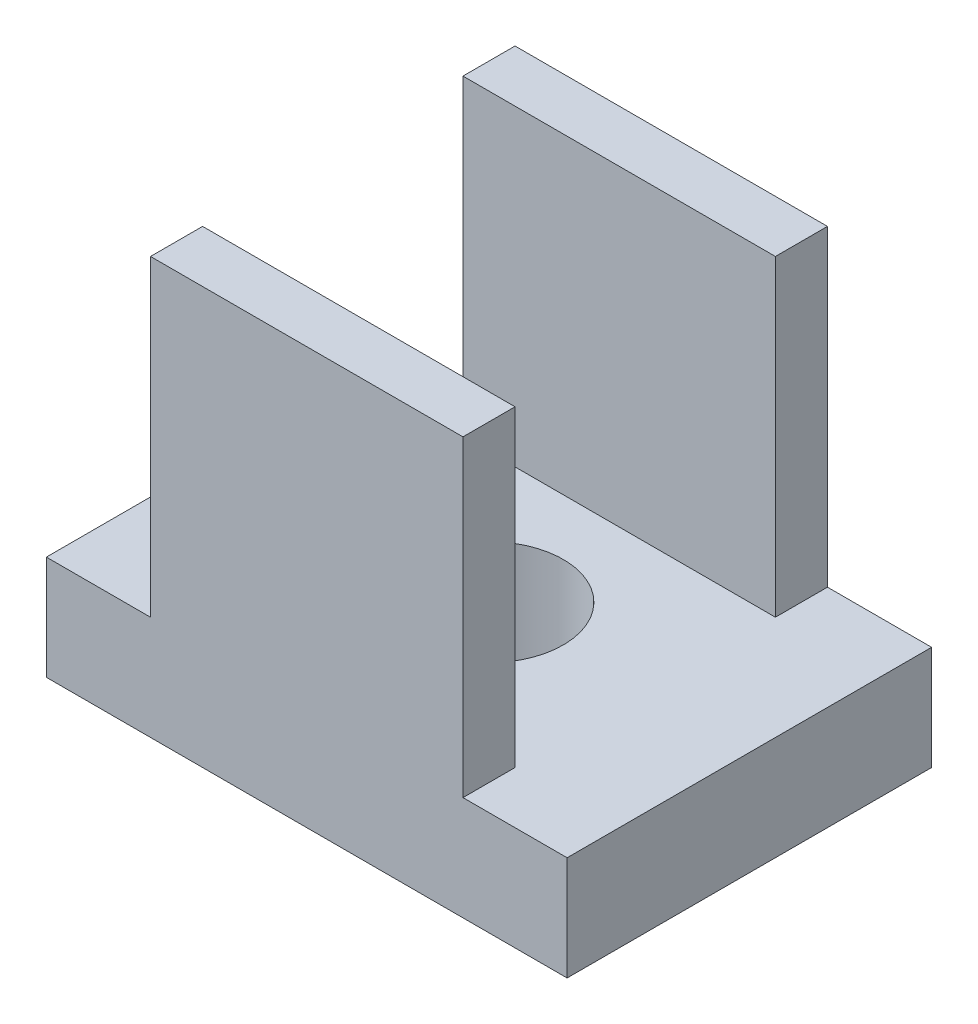
ISO-10303-21;
HEADER;
FILE_DESCRIPTION(('STEP AP214'),'2;1');
FILE_NAME('part.step','',(''),(''),'','','');
FILE_SCHEMA(('AUTOMOTIVE_DESIGN { 1 0 10303 214 1 1 1 1 }'));
ENDSEC;
DATA;
#1=APPLICATION_CONTEXT('core data for automotive mechanical design processes');
#2=APPLICATION_PROTOCOL_DEFINITION('international standard','automotive_design',2000,#1);
#3=PRODUCT_CONTEXT('',#1,'mechanical');
#4=PRODUCT('Part','Part','',(#3));
#5=PRODUCT_RELATED_PRODUCT_CATEGORY('part','',(#4));
#6=PRODUCT_DEFINITION_FORMATION('','',#4);
#7=PRODUCT_DEFINITION_CONTEXT('part definition',#1,'design');
#8=PRODUCT_DEFINITION('design','',#6,#7);
#9=PRODUCT_DEFINITION_SHAPE('','',#8);
#10=(LENGTH_UNIT() NAMED_UNIT(*) SI_UNIT(.MILLI.,.METRE.));
#11=(NAMED_UNIT(*) PLANE_ANGLE_UNIT() SI_UNIT($,.RADIAN.));
#12=(NAMED_UNIT(*) SI_UNIT($,.STERADIAN.) SOLID_ANGLE_UNIT());
#13=UNCERTAINTY_MEASURE_WITH_UNIT(LENGTH_MEASURE(1.E-05),#10,'distance_accuracy_value','');
#14=(GEOMETRIC_REPRESENTATION_CONTEXT(3) GLOBAL_UNCERTAINTY_ASSIGNED_CONTEXT((#13)) GLOBAL_UNIT_ASSIGNED_CONTEXT((#10,
#11,#12)) REPRESENTATION_CONTEXT('',''));
#15=CARTESIAN_POINT('',(0.,0.,0.));
#16=DIRECTION('',(0.,0.,1.));
#17=DIRECTION('',(1.,0.,0.));
#18=AXIS2_PLACEMENT_3D('',#15,#16,#17);
#19=CARTESIAN_POINT('',(0.,2.,0.));
#20=DIRECTION('',(0.,1.,0.));
#21=DIRECTION('',(0.,0.,1.));
#22=AXIS2_PLACEMENT_3D('',#19,#20,#21);
#23=PLANE('',#22);
#24=CARTESIAN_POINT('',(0.,2.,0.));
#25=DIRECTION('',(0.,1.,0.));
#26=DIRECTION('',(0.,0.,1.));
#27=AXIS2_PLACEMENT_3D('',#24,#25,#26);
#28=CIRCLE('',#27,1.425);
#29=CARTESIAN_POINT('',(0.,2.,1.425));
#30=VERTEX_POINT('',#29);
#31=EDGE_CURVE('E201',#30,#30,#28,.T.);
#32=ORIENTED_EDGE('',*,*,#31,.F.);
#33=EDGE_LOOP('',(#32));
#34=FACE_BOUND('',#33,.T.);
#35=DIRECTION('',(1.,0.,0.));
#36=VECTOR('',#35,1.);
#37=CARTESIAN_POINT('',(-5.,2.,3.5));
#38=LINE('',#37,#36);
#39=CARTESIAN_POINT('',(-5.,2.,3.5));
#40=VERTEX_POINT('',#39);
#41=CARTESIAN_POINT('',(-3.,2.,3.5));
#42=VERTEX_POINT('',#41);
#43=EDGE_CURVE('E223',#40,#42,#38,.T.);
#44=ORIENTED_EDGE('',*,*,#43,.T.);
#45=DIRECTION('',(0.,0.,1.));
#46=VECTOR('',#45,1.);
#47=CARTESIAN_POINT('',(-3.,2.,2.5));
#48=LINE('',#47,#46);
#49=CARTESIAN_POINT('',(-3.,2.,2.5));
#50=VERTEX_POINT('',#49);
#51=EDGE_CURVE('E155',#50,#42,#48,.T.);
#52=ORIENTED_EDGE('',*,*,#51,.F.);
#53=DIRECTION('',(-1.,0.,0.));
#54=VECTOR('',#53,1.);
#55=CARTESIAN_POINT('',(-3.,2.,2.5));
#56=LINE('',#55,#54);
#57=CARTESIAN_POINT('',(3.,2.,2.5));
#58=VERTEX_POINT('',#57);
#59=EDGE_CURVE('E151',#58,#50,#56,.T.);
#60=ORIENTED_EDGE('',*,*,#59,.F.);
#61=DIRECTION('',(0.,0.,-1.));
#62=VECTOR('',#61,1.);
#63=CARTESIAN_POINT('',(3.,2.,2.5));
#64=LINE('',#63,#62);
#65=CARTESIAN_POINT('',(3.,2.,3.5));
#66=VERTEX_POINT('',#65);
#67=EDGE_CURVE('E264',#66,#58,#64,.T.);
#68=ORIENTED_EDGE('',*,*,#67,.F.);
#69=CARTESIAN_POINT('',(5.,2.,3.5));
#70=VERTEX_POINT('',#69);
#71=EDGE_CURVE('E222',#66,#70,#38,.T.);
#72=ORIENTED_EDGE('',*,*,#71,.T.);
#73=DIRECTION('',(0.,0.,-1.));
#74=VECTOR('',#73,1.);
#75=CARTESIAN_POINT('',(5.,2.,-3.5));
#76=LINE('',#75,#74);
#77=CARTESIAN_POINT('',(5.,2.,-3.5));
#78=VERTEX_POINT('',#77);
#79=EDGE_CURVE('E210',#70,#78,#76,.T.);
#80=ORIENTED_EDGE('',*,*,#79,.T.);
#81=DIRECTION('',(-1.,0.,0.));
#82=VECTOR('',#81,1.);
#83=CARTESIAN_POINT('',(-5.,2.,-3.5));
#84=LINE('',#83,#82);
#85=CARTESIAN_POINT('',(3.,2.,-3.5));
#86=VERTEX_POINT('',#85);
#87=EDGE_CURVE('E216',#78,#86,#84,.T.);
#88=ORIENTED_EDGE('',*,*,#87,.T.);
#89=DIRECTION('',(0.,0.,-1.));
#90=VECTOR('',#89,1.);
#91=CARTESIAN_POINT('',(3.,2.,-3.5));
#92=LINE('',#91,#90);
#93=CARTESIAN_POINT('',(3.,2.,-2.5));
#94=VERTEX_POINT('',#93);
#95=EDGE_CURVE('E172',#94,#86,#92,.T.);
#96=ORIENTED_EDGE('',*,*,#95,.F.);
#97=DIRECTION('',(1.,0.,0.));
#98=VECTOR('',#97,1.);
#99=CARTESIAN_POINT('',(-3.,2.,-2.5));
#100=LINE('',#99,#98);
#101=CARTESIAN_POINT('',(-3.,2.,-2.5));
#102=VERTEX_POINT('',#101);
#103=EDGE_CURVE('E63',#102,#94,#100,.T.);
#104=ORIENTED_EDGE('',*,*,#103,.F.);
#105=DIRECTION('',(0.,0.,1.));
#106=VECTOR('',#105,1.);
#107=CARTESIAN_POINT('',(-3.,2.,-3.5));
#108=LINE('',#107,#106);
#109=CARTESIAN_POINT('',(-3.,2.,-3.5));
#110=VERTEX_POINT('',#109);
#111=EDGE_CURVE('E158',#110,#102,#108,.T.);
#112=ORIENTED_EDGE('',*,*,#111,.F.);
#113=CARTESIAN_POINT('',(-5.,2.,-3.5));
#114=VERTEX_POINT('',#113);
#115=EDGE_CURVE('E214',#110,#114,#84,.T.);
#116=ORIENTED_EDGE('',*,*,#115,.T.);
#117=DIRECTION('',(0.,0.,1.));
#118=VECTOR('',#117,1.);
#119=CARTESIAN_POINT('',(-5.,2.,-3.5));
#120=LINE('',#119,#118);
#121=EDGE_CURVE('E219',#114,#40,#120,.T.);
#122=ORIENTED_EDGE('',*,*,#121,.T.);
#123=EDGE_LOOP('',(#44,#52,#60,#68,#72,#80,#88,#96,#104,#112,#116,#122));
#124=FACE_BOUND('',#123,.T.);
#125=ADVANCED_FACE('F39',(#34,#124),#23,.T.);
#126=CARTESIAN_POINT('',(5.,2.,-3.5));
#127=DIRECTION('',(-1.,0.,0.));
#128=DIRECTION('',(0.,0.,1.));
#129=AXIS2_PLACEMENT_3D('',#126,#127,#128);
#130=PLANE('',#129);
#131=DIRECTION('',(0.,0.,-1.));
#132=VECTOR('',#131,1.);
#133=CARTESIAN_POINT('',(5.,0.,-3.5));
#134=LINE('',#133,#132);
#135=CARTESIAN_POINT('',(5.,0.,3.5));
#136=VERTEX_POINT('',#135);
#137=CARTESIAN_POINT('',(5.,0.,-3.5));
#138=VERTEX_POINT('',#137);
#139=EDGE_CURVE('E206',#136,#138,#134,.T.);
#140=ORIENTED_EDGE('',*,*,#139,.T.);
#141=DIRECTION('',(0.,-1.,0.));
#142=VECTOR('',#141,1.);
#143=CARTESIAN_POINT('',(5.,2.,-3.5));
#144=LINE('',#143,#142);
#145=EDGE_CURVE('E11',#78,#138,#144,.T.);
#146=ORIENTED_EDGE('',*,*,#145,.F.);
#147=ORIENTED_EDGE('',*,*,#79,.F.);
#148=DIRECTION('',(0.,-1.,0.));
#149=VECTOR('',#148,1.);
#150=CARTESIAN_POINT('',(5.,2.,3.5));
#151=LINE('',#150,#149);
#152=EDGE_CURVE('E226',#70,#136,#151,.T.);
#153=ORIENTED_EDGE('',*,*,#152,.T.);
#154=EDGE_LOOP('',(#140,#146,#147,#153));
#155=FACE_BOUND('',#154,.T.);
#156=ADVANCED_FACE('F41',(#155),#130,.F.);
#157=CARTESIAN_POINT('',(-5.,2.,-3.5));
#158=DIRECTION('',(0.,0.,1.));
#159=DIRECTION('',(1.,0.,0.));
#160=AXIS2_PLACEMENT_3D('',#157,#158,#159);
#161=PLANE('',#160);
#162=DIRECTION('',(-1.,0.,0.));
#163=VECTOR('',#162,1.);
#164=CARTESIAN_POINT('',(-5.,0.,-3.5));
#165=LINE('',#164,#163);
#166=CARTESIAN_POINT('',(-5.,0.,-3.5));
#167=VERTEX_POINT('',#166);
#168=EDGE_CURVE('E230',#138,#167,#165,.T.);
#169=ORIENTED_EDGE('',*,*,#168,.T.);
#170=DIRECTION('',(0.,-1.,0.));
#171=VECTOR('',#170,1.);
#172=CARTESIAN_POINT('',(-5.,2.,-3.5));
#173=LINE('',#172,#171);
#174=EDGE_CURVE('E48',#114,#167,#173,.T.);
#175=ORIENTED_EDGE('',*,*,#174,.F.);
#176=ORIENTED_EDGE('',*,*,#115,.F.);
#177=DIRECTION('',(0.,-1.,0.));
#178=VECTOR('',#177,1.);
#179=CARTESIAN_POINT('',(-3.,8.,-3.5));
#180=LINE('',#179,#178);
#181=CARTESIAN_POINT('',(-3.,8.,-3.5));
#182=VERTEX_POINT('',#181);
#183=EDGE_CURVE('E180',#182,#110,#180,.T.);
#184=ORIENTED_EDGE('',*,*,#183,.F.);
#185=DIRECTION('',(-1.,0.,0.));
#186=VECTOR('',#185,1.);
#187=CARTESIAN_POINT('',(-3.,8.,-3.5));
#188=LINE('',#187,#186);
#189=CARTESIAN_POINT('',(3.,8.,-3.5));
#190=VERTEX_POINT('',#189);
#191=EDGE_CURVE('E178',#190,#182,#188,.T.);
#192=ORIENTED_EDGE('',*,*,#191,.F.);
#193=DIRECTION('',(0.,-1.,0.));
#194=VECTOR('',#193,1.);
#195=CARTESIAN_POINT('',(3.,8.,-3.5));
#196=LINE('',#195,#194);
#197=EDGE_CURVE('E190',#190,#86,#196,.T.);
#198=ORIENTED_EDGE('',*,*,#197,.T.);
#199=ORIENTED_EDGE('',*,*,#87,.F.);
#200=ORIENTED_EDGE('',*,*,#145,.T.);
#201=EDGE_LOOP('',(#169,#175,#176,#184,#192,#198,#199,#200));
#202=FACE_BOUND('',#201,.T.);
#203=ADVANCED_FACE('F268',(#202),#161,.F.);
#204=CARTESIAN_POINT('',(-5.,2.,-3.5));
#205=DIRECTION('',(1.,0.,0.));
#206=DIRECTION('',(0.,0.,-1.));
#207=AXIS2_PLACEMENT_3D('',#204,#205,#206);
#208=PLANE('',#207);
#209=DIRECTION('',(0.,0.,1.));
#210=VECTOR('',#209,1.);
#211=CARTESIAN_POINT('',(-5.,0.,-3.5));
#212=LINE('',#211,#210);
#213=CARTESIAN_POINT('',(-5.,0.,3.5));
#214=VERTEX_POINT('',#213);
#215=EDGE_CURVE('E233',#167,#214,#212,.T.);
#216=ORIENTED_EDGE('',*,*,#215,.T.);
#217=DIRECTION('',(0.,-1.,0.));
#218=VECTOR('',#217,1.);
#219=CARTESIAN_POINT('',(-5.,2.,3.5));
#220=LINE('',#219,#218);
#221=EDGE_CURVE('E241',#40,#214,#220,.T.);
#222=ORIENTED_EDGE('',*,*,#221,.F.);
#223=ORIENTED_EDGE('',*,*,#121,.F.);
#224=ORIENTED_EDGE('',*,*,#174,.T.);
#225=EDGE_LOOP('',(#216,#222,#223,#224));
#226=FACE_BOUND('',#225,.T.);
#227=ADVANCED_FACE('F250',(#226),#208,.F.);
#228=CARTESIAN_POINT('',(-5.,2.,3.5));
#229=DIRECTION('',(0.,0.,-1.));
#230=DIRECTION('',(-1.,0.,0.));
#231=AXIS2_PLACEMENT_3D('',#228,#229,#230);
#232=PLANE('',#231);
#233=DIRECTION('',(1.,0.,0.));
#234=VECTOR('',#233,1.);
#235=CARTESIAN_POINT('',(-5.,0.,3.5));
#236=LINE('',#235,#234);
#237=EDGE_CURVE('E215',#214,#136,#236,.T.);
#238=ORIENTED_EDGE('',*,*,#237,.T.);
#239=ORIENTED_EDGE('',*,*,#152,.F.);
#240=ORIENTED_EDGE('',*,*,#71,.F.);
#241=DIRECTION('',(0.,-1.,0.));
#242=VECTOR('',#241,1.);
#243=CARTESIAN_POINT('',(3.,8.,3.5));
#244=LINE('',#243,#242);
#245=CARTESIAN_POINT('',(3.,8.,3.5));
#246=VERTEX_POINT('',#245);
#247=EDGE_CURVE('E137',#246,#66,#244,.T.);
#248=ORIENTED_EDGE('',*,*,#247,.F.);
#249=DIRECTION('',(1.,0.,0.));
#250=VECTOR('',#249,1.);
#251=CARTESIAN_POINT('',(-3.,8.,3.5));
#252=LINE('',#251,#250);
#253=CARTESIAN_POINT('',(-3.,8.,3.5));
#254=VERTEX_POINT('',#253);
#255=EDGE_CURVE('E129',#254,#246,#252,.T.);
#256=ORIENTED_EDGE('',*,*,#255,.F.);
#257=DIRECTION('',(0.,-1.,0.));
#258=VECTOR('',#257,1.);
#259=CARTESIAN_POINT('',(-3.,8.,3.5));
#260=LINE('',#259,#258);
#261=EDGE_CURVE('E134',#254,#42,#260,.T.);
#262=ORIENTED_EDGE('',*,*,#261,.T.);
#263=ORIENTED_EDGE('',*,*,#43,.F.);
#264=ORIENTED_EDGE('',*,*,#221,.T.);
#265=EDGE_LOOP('',(#238,#239,#240,#248,#256,#262,#263,#264));
#266=FACE_BOUND('',#265,.T.);
#267=ADVANCED_FACE('F131',(#266),#232,.F.);
#268=CARTESIAN_POINT('',(0.,0.,0.));
#269=DIRECTION('',(0.,1.,0.));
#270=DIRECTION('',(0.,0.,1.));
#271=AXIS2_PLACEMENT_3D('',#268,#269,#270);
#272=PLANE('',#271);
#273=CARTESIAN_POINT('',(0.,0.,0.));
#274=DIRECTION('',(0.,1.,0.));
#275=DIRECTION('',(0.,0.,1.));
#276=AXIS2_PLACEMENT_3D('',#273,#274,#275);
#277=CIRCLE('',#276,1.425);
#278=CARTESIAN_POINT('',(0.,0.,1.425));
#279=VERTEX_POINT('',#278);
#280=EDGE_CURVE('E202',#279,#279,#277,.T.);
#281=ORIENTED_EDGE('',*,*,#280,.T.);
#282=EDGE_LOOP('',(#281));
#283=FACE_BOUND('',#282,.T.);
#284=ORIENTED_EDGE('',*,*,#139,.F.);
#285=ORIENTED_EDGE('',*,*,#237,.F.);
#286=ORIENTED_EDGE('',*,*,#215,.F.);
#287=ORIENTED_EDGE('',*,*,#168,.F.);
#288=EDGE_LOOP('',(#284,#285,#286,#287));
#289=FACE_BOUND('',#288,.T.);
#290=ADVANCED_FACE('F257',(#283,#289),#272,.F.);
#291=CARTESIAN_POINT('',(0.,0.,0.));
#292=DIRECTION('',(0.,1.,0.));
#293=DIRECTION('',(0.,0.,1.));
#294=AXIS2_PLACEMENT_3D('',#291,#292,#293);
#295=CYLINDRICAL_SURFACE('',#294,1.425);
#296=ORIENTED_EDGE('',*,*,#280,.F.);
#297=EDGE_LOOP('',(#296));
#298=FACE_BOUND('',#297,.T.);
#299=ORIENTED_EDGE('',*,*,#31,.T.);
#300=EDGE_LOOP('',(#299));
#301=FACE_BOUND('',#300,.T.);
#302=ADVANCED_FACE('F290',(#298,#301),#295,.F.);
#303=CARTESIAN_POINT('',(-3.,8.,-3.5));
#304=DIRECTION('',(1.,0.,0.));
#305=DIRECTION('',(0.,0.,-1.));
#306=AXIS2_PLACEMENT_3D('',#303,#304,#305);
#307=PLANE('',#306);
#308=ORIENTED_EDGE('',*,*,#111,.T.);
#309=DIRECTION('',(0.,-1.,0.));
#310=VECTOR('',#309,1.);
#311=CARTESIAN_POINT('',(-3.,8.,-2.5));
#312=LINE('',#311,#310);
#313=CARTESIAN_POINT('',(-3.,8.,-2.5));
#314=VERTEX_POINT('',#313);
#315=EDGE_CURVE('E198',#314,#102,#312,.T.);
#316=ORIENTED_EDGE('',*,*,#315,.F.);
#317=DIRECTION('',(0.,0.,1.));
#318=VECTOR('',#317,1.);
#319=CARTESIAN_POINT('',(-3.,8.,-3.5));
#320=LINE('',#319,#318);
#321=EDGE_CURVE('E167',#182,#314,#320,.T.);
#322=ORIENTED_EDGE('',*,*,#321,.F.);
#323=ORIENTED_EDGE('',*,*,#183,.T.);
#324=EDGE_LOOP('',(#308,#316,#322,#323));
#325=FACE_BOUND('',#324,.T.);
#326=ADVANCED_FACE('F272',(#325),#307,.F.);
#327=CARTESIAN_POINT('',(-3.,8.,-2.5));
#328=DIRECTION('',(0.,0.,-1.));
#329=DIRECTION('',(-1.,0.,0.));
#330=AXIS2_PLACEMENT_3D('',#327,#328,#329);
#331=PLANE('',#330);
#332=ORIENTED_EDGE('',*,*,#103,.T.);
#333=DIRECTION('',(0.,-1.,0.));
#334=VECTOR('',#333,1.);
#335=CARTESIAN_POINT('',(3.,8.,-2.5));
#336=LINE('',#335,#334);
#337=CARTESIAN_POINT('',(3.,8.,-2.5));
#338=VERTEX_POINT('',#337);
#339=EDGE_CURVE('E194',#338,#94,#336,.T.);
#340=ORIENTED_EDGE('',*,*,#339,.F.);
#341=DIRECTION('',(1.,0.,0.));
#342=VECTOR('',#341,1.);
#343=CARTESIAN_POINT('',(-3.,8.,-2.5));
#344=LINE('',#343,#342);
#345=EDGE_CURVE('E171',#314,#338,#344,.T.);
#346=ORIENTED_EDGE('',*,*,#345,.F.);
#347=ORIENTED_EDGE('',*,*,#315,.T.);
#348=EDGE_LOOP('',(#332,#340,#346,#347));
#349=FACE_BOUND('',#348,.T.);
#350=ADVANCED_FACE('F282',(#349),#331,.F.);
#351=CARTESIAN_POINT('',(3.,8.,-3.5));
#352=DIRECTION('',(-1.,0.,0.));
#353=DIRECTION('',(0.,0.,1.));
#354=AXIS2_PLACEMENT_3D('',#351,#352,#353);
#355=PLANE('',#354);
#356=ORIENTED_EDGE('',*,*,#95,.T.);
#357=ORIENTED_EDGE('',*,*,#197,.F.);
#358=DIRECTION('',(0.,0.,-1.));
#359=VECTOR('',#358,1.);
#360=CARTESIAN_POINT('',(3.,8.,-3.5));
#361=LINE('',#360,#359);
#362=EDGE_CURVE('E175',#338,#190,#361,.T.);
#363=ORIENTED_EDGE('',*,*,#362,.F.);
#364=ORIENTED_EDGE('',*,*,#339,.T.);
#365=EDGE_LOOP('',(#356,#357,#363,#364));
#366=FACE_BOUND('',#365,.T.);
#367=ADVANCED_FACE('F280',(#366),#355,.F.);
#368=CARTESIAN_POINT('',(0.,8.,0.));
#369=DIRECTION('',(0.,1.,0.));
#370=DIRECTION('',(0.,0.,1.));
#371=AXIS2_PLACEMENT_3D('',#368,#369,#370);
#372=PLANE('',#371);
#373=ORIENTED_EDGE('',*,*,#321,.T.);
#374=ORIENTED_EDGE('',*,*,#345,.T.);
#375=ORIENTED_EDGE('',*,*,#362,.T.);
#376=ORIENTED_EDGE('',*,*,#191,.T.);
#377=EDGE_LOOP('',(#373,#374,#375,#376));
#378=FACE_BOUND('',#377,.T.);
#379=ADVANCED_FACE('F275',(#378),#372,.T.);
#380=CARTESIAN_POINT('',(-3.,8.,2.5));
#381=DIRECTION('',(1.,0.,0.));
#382=DIRECTION('',(0.,0.,-1.));
#383=AXIS2_PLACEMENT_3D('',#380,#381,#382);
#384=PLANE('',#383);
#385=ORIENTED_EDGE('',*,*,#51,.T.);
#386=ORIENTED_EDGE('',*,*,#261,.F.);
#387=DIRECTION('',(0.,0.,1.));
#388=VECTOR('',#387,1.);
#389=CARTESIAN_POINT('',(-3.,8.,2.5));
#390=LINE('',#389,#388);
#391=CARTESIAN_POINT('',(-3.,8.,2.5));
#392=VERTEX_POINT('',#391);
#393=EDGE_CURVE('E142',#392,#254,#390,.T.);
#394=ORIENTED_EDGE('',*,*,#393,.F.);
#395=DIRECTION('',(0.,-1.,0.));
#396=VECTOR('',#395,1.);
#397=CARTESIAN_POINT('',(-3.,8.,2.5));
#398=LINE('',#397,#396);
#399=EDGE_CURVE('E379',#392,#50,#398,.T.);
#400=ORIENTED_EDGE('',*,*,#399,.T.);
#401=EDGE_LOOP('',(#385,#386,#394,#400));
#402=FACE_BOUND('',#401,.T.);
#403=ADVANCED_FACE('F153',(#402),#384,.F.);
#404=CARTESIAN_POINT('',(3.,8.,2.5));
#405=DIRECTION('',(-1.,0.,0.));
#406=DIRECTION('',(0.,0.,1.));
#407=AXIS2_PLACEMENT_3D('',#404,#405,#406);
#408=PLANE('',#407);
#409=ORIENTED_EDGE('',*,*,#67,.T.);
#410=DIRECTION('',(0.,-1.,0.));
#411=VECTOR('',#410,1.);
#412=CARTESIAN_POINT('',(3.,8.,2.5));
#413=LINE('',#412,#411);
#414=CARTESIAN_POINT('',(3.,8.,2.5));
#415=VERTEX_POINT('',#414);
#416=EDGE_CURVE('E55',#415,#58,#413,.T.);
#417=ORIENTED_EDGE('',*,*,#416,.F.);
#418=DIRECTION('',(0.,0.,-1.));
#419=VECTOR('',#418,1.);
#420=CARTESIAN_POINT('',(3.,8.,2.5));
#421=LINE('',#420,#419);
#422=EDGE_CURVE('E141',#246,#415,#421,.T.);
#423=ORIENTED_EDGE('',*,*,#422,.F.);
#424=ORIENTED_EDGE('',*,*,#247,.T.);
#425=EDGE_LOOP('',(#409,#417,#423,#424));
#426=FACE_BOUND('',#425,.T.);
#427=ADVANCED_FACE('F349',(#426),#408,.F.);
#428=CARTESIAN_POINT('',(-3.,8.,2.5));
#429=DIRECTION('',(0.,0.,1.));
#430=DIRECTION('',(1.,0.,0.));
#431=AXIS2_PLACEMENT_3D('',#428,#429,#430);
#432=PLANE('',#431);
#433=ORIENTED_EDGE('',*,*,#59,.T.);
#434=ORIENTED_EDGE('',*,*,#399,.F.);
#435=DIRECTION('',(-1.,0.,0.));
#436=VECTOR('',#435,1.);
#437=CARTESIAN_POINT('',(-3.,8.,2.5));
#438=LINE('',#437,#436);
#439=EDGE_CURVE('E146',#415,#392,#438,.T.);
#440=ORIENTED_EDGE('',*,*,#439,.F.);
#441=ORIENTED_EDGE('',*,*,#416,.T.);
#442=EDGE_LOOP('',(#433,#434,#440,#441));
#443=FACE_BOUND('',#442,.T.);
#444=ADVANCED_FACE('F358',(#443),#432,.F.);
#445=CARTESIAN_POINT('',(0.,8.,0.));
#446=DIRECTION('',(0.,1.,0.));
#447=DIRECTION('',(0.,0.,1.));
#448=AXIS2_PLACEMENT_3D('',#445,#446,#447);
#449=PLANE('',#448);
#450=ORIENTED_EDGE('',*,*,#393,.T.);
#451=ORIENTED_EDGE('',*,*,#255,.T.);
#452=ORIENTED_EDGE('',*,*,#422,.T.);
#453=ORIENTED_EDGE('',*,*,#439,.T.);
#454=EDGE_LOOP('',(#450,#451,#452,#453));
#455=FACE_BOUND('',#454,.T.);
#456=ADVANCED_FACE('F145',(#455),#449,.T.);
#457=CLOSED_SHELL('',(#125,#156,#203,#227,#267,#290,#302,#326,#350,#367,#379,#403,#427,#444,#456));
#458=MANIFOLD_SOLID_BREP('B2',#457);
#459=ADVANCED_BREP_SHAPE_REPRESENTATION('',(#18,#458),#14);
#460=SHAPE_DEFINITION_REPRESENTATION(#9,#459);
ENDSEC;
END-ISO-10303-21;
